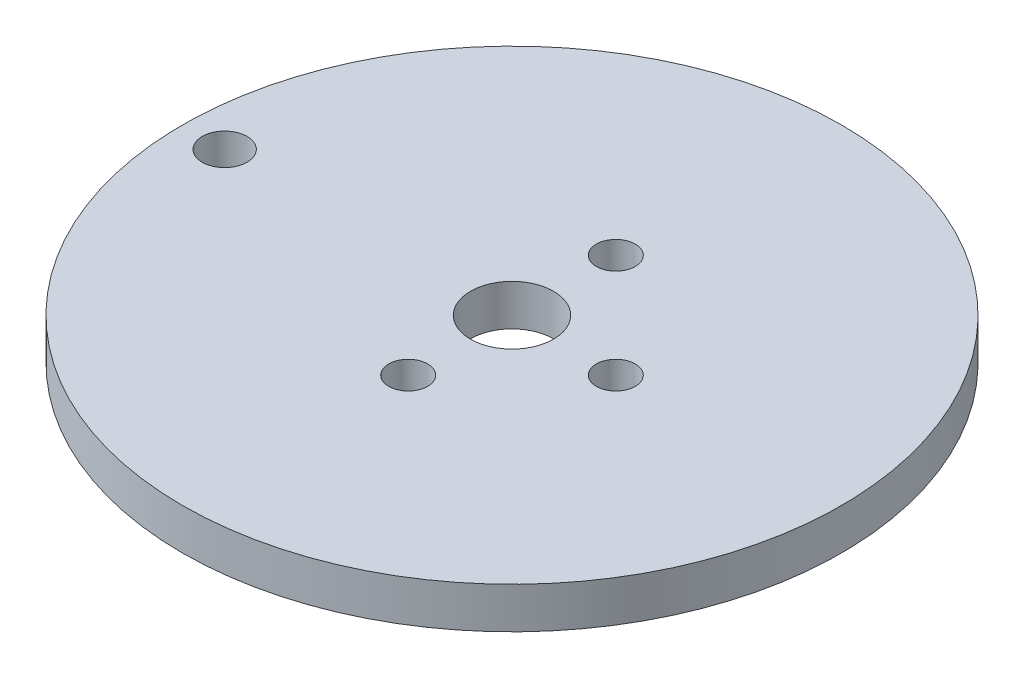
ISO-10303-21;
HEADER;
FILE_DESCRIPTION(('STEP AP214'),'2;1');
FILE_NAME('part.step','',(''),(''),'','','');
FILE_SCHEMA(('AUTOMOTIVE_DESIGN { 1 0 10303 214 1 1 1 1 }'));
ENDSEC;
DATA;
#1=APPLICATION_CONTEXT('core data for automotive mechanical design processes');
#2=APPLICATION_PROTOCOL_DEFINITION('international standard','automotive_design',2000,#1);
#3=PRODUCT_CONTEXT('',#1,'mechanical');
#4=PRODUCT('Part','Part','',(#3));
#5=PRODUCT_RELATED_PRODUCT_CATEGORY('part','',(#4));
#6=PRODUCT_DEFINITION_FORMATION('','',#4);
#7=PRODUCT_DEFINITION_CONTEXT('part definition',#1,'design');
#8=PRODUCT_DEFINITION('design','',#6,#7);
#9=PRODUCT_DEFINITION_SHAPE('','',#8);
#10=(LENGTH_UNIT() NAMED_UNIT(*) SI_UNIT(.MILLI.,.METRE.));
#11=(NAMED_UNIT(*) PLANE_ANGLE_UNIT() SI_UNIT($,.RADIAN.));
#12=(NAMED_UNIT(*) SI_UNIT($,.STERADIAN.) SOLID_ANGLE_UNIT());
#13=UNCERTAINTY_MEASURE_WITH_UNIT(LENGTH_MEASURE(1.E-05),#10,'distance_accuracy_value','');
#14=(GEOMETRIC_REPRESENTATION_CONTEXT(3) GLOBAL_UNCERTAINTY_ASSIGNED_CONTEXT((#13)) GLOBAL_UNIT_ASSIGNED_CONTEXT((#10,
#11,#12)) REPRESENTATION_CONTEXT('',''));
#15=CARTESIAN_POINT('',(0.,0.,0.));
#16=DIRECTION('',(0.,0.,1.));
#17=DIRECTION('',(1.,0.,0.));
#18=AXIS2_PLACEMENT_3D('',#15,#16,#17);
#19=CARTESIAN_POINT('',(0.,3.175,0.));
#20=DIRECTION('',(0.,-1.,0.));
#21=DIRECTION('',(0.,0.,-1.));
#22=AXIS2_PLACEMENT_3D('',#19,#20,#21);
#23=CYLINDRICAL_SURFACE('',#22,25.4);
#24=CARTESIAN_POINT('',(0.,3.175,0.));
#25=DIRECTION('',(0.,1.,0.));
#26=DIRECTION('',(0.,0.,1.));
#27=AXIS2_PLACEMENT_3D('',#24,#25,#26);
#28=CIRCLE('',#27,25.4);
#29=CARTESIAN_POINT('',(0.,3.175,25.4));
#30=VERTEX_POINT('',#29);
#31=EDGE_CURVE('E10',#30,#30,#28,.T.);
#32=ORIENTED_EDGE('',*,*,#31,.F.);
#33=EDGE_LOOP('',(#32));
#34=FACE_BOUND('',#33,.T.);
#35=CARTESIAN_POINT('',(0.,0.,0.));
#36=DIRECTION('',(0.,1.,0.));
#37=DIRECTION('',(0.,0.,1.));
#38=AXIS2_PLACEMENT_3D('',#35,#36,#37);
#39=CIRCLE('',#38,25.4);
#40=CARTESIAN_POINT('',(0.,0.,25.4));
#41=VERTEX_POINT('',#40);
#42=EDGE_CURVE('E38',#41,#41,#39,.T.);
#43=ORIENTED_EDGE('',*,*,#42,.T.);
#44=EDGE_LOOP('',(#43));
#45=FACE_BOUND('',#44,.T.);
#46=ADVANCED_FACE('F35',(#34,#45),#23,.T.);
#47=CARTESIAN_POINT('',(0.,3.175,0.));
#48=DIRECTION('',(0.,1.,0.));
#49=DIRECTION('',(0.,0.,1.));
#50=AXIS2_PLACEMENT_3D('',#47,#48,#49);
#51=PLANE('',#50);
#52=CARTESIAN_POINT('',(0.,3.175,-7.999984));
#53=DIRECTION('',(0.,1.,0.));
#54=DIRECTION('',(0.,0.,1.));
#55=AXIS2_PLACEMENT_3D('',#52,#53,#54);
#56=CIRCLE('',#55,1.499997);
#57=CARTESIAN_POINT('',(0.,3.175,-6.499987));
#58=VERTEX_POINT('',#57);
#59=EDGE_CURVE('E71',#58,#58,#56,.T.);
#60=ORIENTED_EDGE('',*,*,#59,.F.);
#61=EDGE_LOOP('',(#60));
#62=FACE_BOUND('',#61,.T.);
#63=CARTESIAN_POINT('',(0.,3.175,7.999984));
#64=DIRECTION('',(0.,1.,0.));
#65=DIRECTION('',(0.,0.,1.));
#66=AXIS2_PLACEMENT_3D('',#63,#64,#65);
#67=CIRCLE('',#66,1.499997);
#68=CARTESIAN_POINT('',(0.,3.175,9.499981));
#69=VERTEX_POINT('',#68);
#70=EDGE_CURVE('E68',#69,#69,#67,.T.);
#71=ORIENTED_EDGE('',*,*,#70,.F.);
#72=EDGE_LOOP('',(#71));
#73=FACE_BOUND('',#72,.T.);
#74=CARTESIAN_POINT('',(7.999984,3.175,0.));
#75=DIRECTION('',(0.,1.,0.));
#76=DIRECTION('',(0.,0.,1.));
#77=AXIS2_PLACEMENT_3D('',#74,#75,#76);
#78=CIRCLE('',#77,1.499997);
#79=CARTESIAN_POINT('',(7.999984,3.175,1.499997));
#80=VERTEX_POINT('',#79);
#81=EDGE_CURVE('E62',#80,#80,#78,.T.);
#82=ORIENTED_EDGE('',*,*,#81,.F.);
#83=EDGE_LOOP('',(#82));
#84=FACE_BOUND('',#83,.T.);
#85=CARTESIAN_POINT('',(0.,3.175,0.));
#86=DIRECTION('',(0.,1.,0.));
#87=DIRECTION('',(0.,0.,1.));
#88=AXIS2_PLACEMENT_3D('',#85,#86,#87);
#89=CIRCLE('',#88,3.2004);
#90=CARTESIAN_POINT('',(0.,3.175,3.2004));
#91=VERTEX_POINT('',#90);
#92=EDGE_CURVE('E53',#91,#91,#89,.T.);
#93=ORIENTED_EDGE('',*,*,#92,.F.);
#94=EDGE_LOOP('',(#93));
#95=FACE_BOUND('',#94,.T.);
#96=CARTESIAN_POINT('',(-22.14499,3.175,0.));
#97=DIRECTION('',(0.,1.,0.));
#98=DIRECTION('',(0.,0.,1.));
#99=AXIS2_PLACEMENT_3D('',#96,#97,#98);
#100=CIRCLE('',#99,1.7272);
#101=CARTESIAN_POINT('',(-22.14499,3.175,1.7272));
#102=VERTEX_POINT('',#101);
#103=EDGE_CURVE('E47',#102,#102,#100,.T.);
#104=ORIENTED_EDGE('',*,*,#103,.F.);
#105=EDGE_LOOP('',(#104));
#106=FACE_BOUND('',#105,.T.);
#107=ORIENTED_EDGE('',*,*,#31,.T.);
#108=EDGE_LOOP('',(#107));
#109=FACE_BOUND('',#108,.T.);
#110=ADVANCED_FACE('F87',(#62,#73,#84,#95,#106,#109),#51,.T.);
#111=CARTESIAN_POINT('',(0.,0.,0.));
#112=DIRECTION('',(0.,1.,0.));
#113=DIRECTION('',(0.,0.,1.));
#114=AXIS2_PLACEMENT_3D('',#111,#112,#113);
#115=PLANE('',#114);
#116=CARTESIAN_POINT('',(0.,0.,-7.999984));
#117=DIRECTION('',(0.,1.,0.));
#118=DIRECTION('',(0.,0.,1.));
#119=AXIS2_PLACEMENT_3D('',#116,#117,#118);
#120=CIRCLE('',#119,1.499997);
#121=CARTESIAN_POINT('',(0.,0.,-6.499987));
#122=VERTEX_POINT('',#121);
#123=EDGE_CURVE('E56',#122,#122,#120,.T.);
#124=ORIENTED_EDGE('',*,*,#123,.T.);
#125=EDGE_LOOP('',(#124));
#126=FACE_BOUND('',#125,.T.);
#127=CARTESIAN_POINT('',(0.,0.,7.999984));
#128=DIRECTION('',(0.,1.,0.));
#129=DIRECTION('',(0.,0.,1.));
#130=AXIS2_PLACEMENT_3D('',#127,#128,#129);
#131=CIRCLE('',#130,1.499997);
#132=CARTESIAN_POINT('',(0.,0.,9.499981));
#133=VERTEX_POINT('',#132);
#134=EDGE_CURVE('E65',#133,#133,#131,.T.);
#135=ORIENTED_EDGE('',*,*,#134,.T.);
#136=EDGE_LOOP('',(#135));
#137=FACE_BOUND('',#136,.T.);
#138=CARTESIAN_POINT('',(7.999984,0.,0.));
#139=DIRECTION('',(0.,1.,0.));
#140=DIRECTION('',(0.,0.,1.));
#141=AXIS2_PLACEMENT_3D('',#138,#139,#140);
#142=CIRCLE('',#141,1.499997);
#143=CARTESIAN_POINT('',(7.999984,0.,1.499997));
#144=VERTEX_POINT('',#143);
#145=EDGE_CURVE('E59',#144,#144,#142,.T.);
#146=ORIENTED_EDGE('',*,*,#145,.T.);
#147=EDGE_LOOP('',(#146));
#148=FACE_BOUND('',#147,.T.);
#149=CARTESIAN_POINT('',(0.,0.,0.));
#150=DIRECTION('',(0.,1.,0.));
#151=DIRECTION('',(0.,0.,1.));
#152=AXIS2_PLACEMENT_3D('',#149,#150,#151);
#153=CIRCLE('',#152,3.2004);
#154=CARTESIAN_POINT('',(0.,0.,3.2004));
#155=VERTEX_POINT('',#154);
#156=EDGE_CURVE('E50',#155,#155,#153,.T.);
#157=ORIENTED_EDGE('',*,*,#156,.T.);
#158=EDGE_LOOP('',(#157));
#159=FACE_BOUND('',#158,.T.);
#160=CARTESIAN_POINT('',(-22.14499,0.,0.));
#161=DIRECTION('',(0.,1.,0.));
#162=DIRECTION('',(0.,0.,1.));
#163=AXIS2_PLACEMENT_3D('',#160,#161,#162);
#164=CIRCLE('',#163,1.7272);
#165=CARTESIAN_POINT('',(-22.14499,0.,1.7272));
#166=VERTEX_POINT('',#165);
#167=EDGE_CURVE('E45',#166,#166,#164,.T.);
#168=ORIENTED_EDGE('',*,*,#167,.T.);
#169=EDGE_LOOP('',(#168));
#170=FACE_BOUND('',#169,.T.);
#171=ORIENTED_EDGE('',*,*,#42,.F.);
#172=EDGE_LOOP('',(#171));
#173=FACE_BOUND('',#172,.T.);
#174=ADVANCED_FACE('F77',(#126,#137,#148,#159,#170,#173),#115,.F.);
#175=CARTESIAN_POINT('',(-22.14499,0.,0.));
#176=DIRECTION('',(0.,1.,0.));
#177=DIRECTION('',(0.,0.,1.));
#178=AXIS2_PLACEMENT_3D('',#175,#176,#177);
#179=CYLINDRICAL_SURFACE('',#178,1.7272);
#180=ORIENTED_EDGE('',*,*,#167,.F.);
#181=EDGE_LOOP('',(#180));
#182=FACE_BOUND('',#181,.T.);
#183=ORIENTED_EDGE('',*,*,#103,.T.);
#184=EDGE_LOOP('',(#183));
#185=FACE_BOUND('',#184,.T.);
#186=ADVANCED_FACE('F99',(#182,#185),#179,.F.);
#187=CARTESIAN_POINT('',(0.,0.,0.));
#188=DIRECTION('',(0.,1.,0.));
#189=DIRECTION('',(0.,0.,1.));
#190=AXIS2_PLACEMENT_3D('',#187,#188,#189);
#191=CYLINDRICAL_SURFACE('',#190,3.2004);
#192=ORIENTED_EDGE('',*,*,#156,.F.);
#193=EDGE_LOOP('',(#192));
#194=FACE_BOUND('',#193,.T.);
#195=ORIENTED_EDGE('',*,*,#92,.T.);
#196=EDGE_LOOP('',(#195));
#197=FACE_BOUND('',#196,.T.);
#198=ADVANCED_FACE('F101',(#194,#197),#191,.F.);
#199=CARTESIAN_POINT('',(7.999984,0.,0.));
#200=DIRECTION('',(0.,1.,0.));
#201=DIRECTION('',(0.,0.,1.));
#202=AXIS2_PLACEMENT_3D('',#199,#200,#201);
#203=CYLINDRICAL_SURFACE('',#202,1.499997);
#204=ORIENTED_EDGE('',*,*,#145,.F.);
#205=EDGE_LOOP('',(#204));
#206=FACE_BOUND('',#205,.T.);
#207=ORIENTED_EDGE('',*,*,#81,.T.);
#208=EDGE_LOOP('',(#207));
#209=FACE_BOUND('',#208,.T.);
#210=ADVANCED_FACE('F108',(#206,#209),#203,.F.);
#211=CARTESIAN_POINT('',(0.,0.,7.999984));
#212=DIRECTION('',(0.,1.,0.));
#213=DIRECTION('',(0.,0.,1.));
#214=AXIS2_PLACEMENT_3D('',#211,#212,#213);
#215=CYLINDRICAL_SURFACE('',#214,1.499997);
#216=ORIENTED_EDGE('',*,*,#134,.F.);
#217=EDGE_LOOP('',(#216));
#218=FACE_BOUND('',#217,.T.);
#219=ORIENTED_EDGE('',*,*,#70,.T.);
#220=EDGE_LOOP('',(#219));
#221=FACE_BOUND('',#220,.T.);
#222=ADVANCED_FACE('F83',(#218,#221),#215,.F.);
#223=CARTESIAN_POINT('',(0.,0.,-7.999984));
#224=DIRECTION('',(0.,1.,0.));
#225=DIRECTION('',(0.,0.,1.));
#226=AXIS2_PLACEMENT_3D('',#223,#224,#225);
#227=CYLINDRICAL_SURFACE('',#226,1.499997);
#228=ORIENTED_EDGE('',*,*,#123,.F.);
#229=EDGE_LOOP('',(#228));
#230=FACE_BOUND('',#229,.T.);
#231=ORIENTED_EDGE('',*,*,#59,.T.);
#232=EDGE_LOOP('',(#231));
#233=FACE_BOUND('',#232,.T.);
#234=ADVANCED_FACE('F80',(#230,#233),#227,.F.);
#235=CLOSED_SHELL('',(#46,#110,#174,#186,#198,#210,#222,#234));
#236=MANIFOLD_SOLID_BREP('B2',#235);
#237=ADVANCED_BREP_SHAPE_REPRESENTATION('',(#18,#236),#14);
#238=SHAPE_DEFINITION_REPRESENTATION(#9,#237);
ENDSEC;
END-ISO-10303-21;
